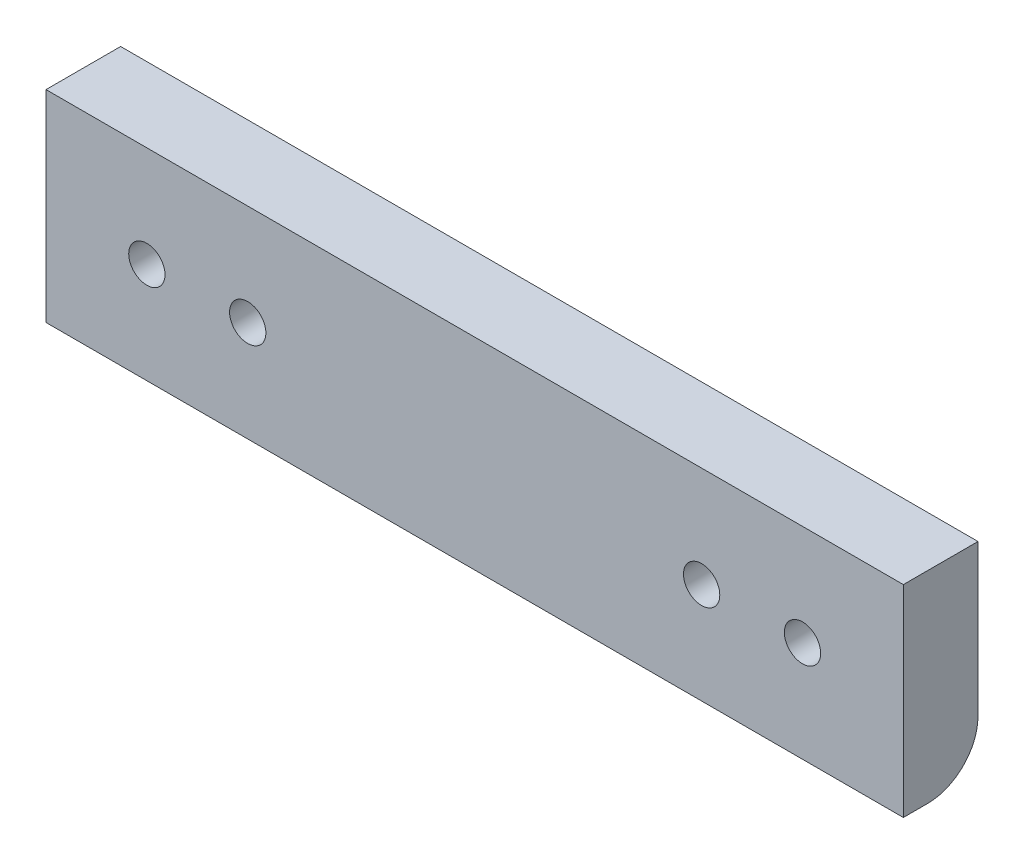
ISO-10303-21;
HEADER;
FILE_DESCRIPTION(('STEP AP214'),'2;1');
FILE_NAME('part.step','',(''),(''),'','','');
FILE_SCHEMA(('AUTOMOTIVE_DESIGN { 1 0 10303 214 1 1 1 1 }'));
ENDSEC;
DATA;
#1=APPLICATION_CONTEXT('core data for automotive mechanical design processes');
#2=APPLICATION_PROTOCOL_DEFINITION('international standard','automotive_design',2000,#1);
#3=PRODUCT_CONTEXT('',#1,'mechanical');
#4=PRODUCT('Part','Part','',(#3));
#5=PRODUCT_RELATED_PRODUCT_CATEGORY('part','',(#4));
#6=PRODUCT_DEFINITION_FORMATION('','',#4);
#7=PRODUCT_DEFINITION_CONTEXT('part definition',#1,'design');
#8=PRODUCT_DEFINITION('design','',#6,#7);
#9=PRODUCT_DEFINITION_SHAPE('','',#8);
#10=(LENGTH_UNIT() NAMED_UNIT(*) SI_UNIT(.MILLI.,.METRE.));
#11=(NAMED_UNIT(*) PLANE_ANGLE_UNIT() SI_UNIT($,.RADIAN.));
#12=(NAMED_UNIT(*) SI_UNIT($,.STERADIAN.) SOLID_ANGLE_UNIT());
#13=UNCERTAINTY_MEASURE_WITH_UNIT(LENGTH_MEASURE(1.E-05),#10,'distance_accuracy_value','');
#14=(GEOMETRIC_REPRESENTATION_CONTEXT(3) GLOBAL_UNCERTAINTY_ASSIGNED_CONTEXT((#13)) GLOBAL_UNIT_ASSIGNED_CONTEXT((#10,
#11,#12)) REPRESENTATION_CONTEXT('',''));
#15=CARTESIAN_POINT('',(0.,0.,0.));
#16=DIRECTION('',(0.,0.,1.));
#17=DIRECTION('',(1.,0.,0.));
#18=AXIS2_PLACEMENT_3D('',#15,#16,#17);
#19=CARTESIAN_POINT('',(-32.5,0.,7.4));
#20=DIRECTION('',(0.,0.,-1.));
#21=DIRECTION('',(-1.,0.,0.));
#22=AXIS2_PLACEMENT_3D('',#19,#20,#21);
#23=CYLINDRICAL_SURFACE('',#22,1.8);
#24=CARTESIAN_POINT('',(-32.5,0.,7.4));
#25=DIRECTION('',(0.,0.,1.));
#26=DIRECTION('',(1.,0.,0.));
#27=AXIS2_PLACEMENT_3D('',#24,#25,#26);
#28=CIRCLE('',#27,1.8);
#29=CARTESIAN_POINT('',(-30.7,0.,7.4));
#30=VERTEX_POINT('',#29);
#31=EDGE_CURVE('E437',#30,#30,#28,.T.);
#32=ORIENTED_EDGE('',*,*,#31,.T.);
#33=EDGE_LOOP('',(#32));
#34=FACE_BOUND('',#33,.T.);
#35=CARTESIAN_POINT('',(-32.5,0.,4.4));
#36=DIRECTION('',(0.,0.,-1.));
#37=DIRECTION('',(-1.,0.,0.));
#38=AXIS2_PLACEMENT_3D('',#35,#36,#37);
#39=CIRCLE('',#38,1.8);
#40=CARTESIAN_POINT('',(-34.3,0.,4.4));
#41=VERTEX_POINT('',#40);
#42=EDGE_CURVE('E431',#41,#41,#39,.T.);
#43=ORIENTED_EDGE('',*,*,#42,.T.);
#44=EDGE_LOOP('',(#43));
#45=FACE_BOUND('',#44,.T.);
#46=ADVANCED_FACE('F34',(#34,#45),#23,.F.);
#47=CARTESIAN_POINT('',(22.5,0.,7.4));
#48=DIRECTION('',(0.,0.,-1.));
#49=DIRECTION('',(-1.,0.,0.));
#50=AXIS2_PLACEMENT_3D('',#47,#48,#49);
#51=CYLINDRICAL_SURFACE('',#50,1.8);
#52=CARTESIAN_POINT('',(22.5,0.,7.4));
#53=DIRECTION('',(0.,0.,1.));
#54=DIRECTION('',(1.,0.,0.));
#55=AXIS2_PLACEMENT_3D('',#52,#53,#54);
#56=CIRCLE('',#55,1.8);
#57=CARTESIAN_POINT('',(24.3,0.,7.4));
#58=VERTEX_POINT('',#57);
#59=EDGE_CURVE('E427',#58,#58,#56,.T.);
#60=ORIENTED_EDGE('',*,*,#59,.T.);
#61=EDGE_LOOP('',(#60));
#62=FACE_BOUND('',#61,.T.);
#63=CARTESIAN_POINT('',(22.5,0.,4.4));
#64=DIRECTION('',(0.,0.,-1.));
#65=DIRECTION('',(-1.,0.,0.));
#66=AXIS2_PLACEMENT_3D('',#63,#64,#65);
#67=CIRCLE('',#66,1.8);
#68=CARTESIAN_POINT('',(20.7,0.,4.4));
#69=VERTEX_POINT('',#68);
#70=EDGE_CURVE('E276',#69,#69,#67,.T.);
#71=ORIENTED_EDGE('',*,*,#70,.T.);
#72=EDGE_LOOP('',(#71));
#73=FACE_BOUND('',#72,.T.);
#74=ADVANCED_FACE('F504',(#62,#73),#51,.F.);
#75=CARTESIAN_POINT('',(0.,0.,7.4));
#76=DIRECTION('',(0.,0.,1.));
#77=DIRECTION('',(1.,0.,0.));
#78=AXIS2_PLACEMENT_3D('',#75,#76,#77);
#79=PLANE('',#78);
#80=CARTESIAN_POINT('',(32.5,0.,7.4));
#81=DIRECTION('',(0.,0.,1.));
#82=DIRECTION('',(-1.,0.,0.));
#83=AXIS2_PLACEMENT_3D('',#80,#81,#82);
#84=CIRCLE('',#83,1.8);
#85=CARTESIAN_POINT('',(30.7,0.,7.4));
#86=VERTEX_POINT('',#85);
#87=EDGE_CURVE('E430',#86,#86,#84,.T.);
#88=ORIENTED_EDGE('',*,*,#87,.F.);
#89=EDGE_LOOP('',(#88));
#90=FACE_BOUND('',#89,.T.);
#91=ORIENTED_EDGE('',*,*,#31,.F.);
#92=EDGE_LOOP('',(#91));
#93=FACE_BOUND('',#92,.T.);
#94=DIRECTION('',(0.,-1.,0.));
#95=VECTOR('',#94,1.);
#96=CARTESIAN_POINT('',(-42.5,-10.,7.4));
#97=LINE('',#96,#95);
#98=CARTESIAN_POINT('',(-42.5,10.,7.4));
#99=VERTEX_POINT('',#98);
#100=CARTESIAN_POINT('',(-42.5,-10.,7.4));
#101=VERTEX_POINT('',#100);
#102=EDGE_CURVE('E441',#99,#101,#97,.T.);
#103=ORIENTED_EDGE('',*,*,#102,.T.);
#104=DIRECTION('',(1.,0.,0.));
#105=VECTOR('',#104,1.);
#106=CARTESIAN_POINT('',(42.5,-10.,7.4));
#107=LINE('',#106,#105);
#108=CARTESIAN_POINT('',(42.5,-10.,7.4));
#109=VERTEX_POINT('',#108);
#110=EDGE_CURVE('E444',#101,#109,#107,.T.);
#111=ORIENTED_EDGE('',*,*,#110,.T.);
#112=DIRECTION('',(0.,1.,0.));
#113=VECTOR('',#112,1.);
#114=CARTESIAN_POINT('',(42.5,-10.,7.4));
#115=LINE('',#114,#113);
#116=CARTESIAN_POINT('',(42.5,10.,7.4));
#117=VERTEX_POINT('',#116);
#118=EDGE_CURVE('E447',#109,#117,#115,.T.);
#119=ORIENTED_EDGE('',*,*,#118,.T.);
#120=DIRECTION('',(-1.,0.,0.));
#121=VECTOR('',#120,1.);
#122=CARTESIAN_POINT('',(42.5,10.,7.4));
#123=LINE('',#122,#121);
#124=EDGE_CURVE('E449',#117,#99,#123,.T.);
#125=ORIENTED_EDGE('',*,*,#124,.T.);
#126=EDGE_LOOP('',(#103,#111,#119,#125));
#127=FACE_BOUND('',#126,.T.);
#128=CARTESIAN_POINT('',(-22.5,0.,7.4));
#129=DIRECTION('',(0.,0.,1.));
#130=DIRECTION('',(-1.,0.,0.));
#131=AXIS2_PLACEMENT_3D('',#128,#129,#130);
#132=CIRCLE('',#131,1.8);
#133=CARTESIAN_POINT('',(-24.3,0.,7.4));
#134=VERTEX_POINT('',#133);
#135=EDGE_CURVE('E434',#134,#134,#132,.T.);
#136=ORIENTED_EDGE('',*,*,#135,.F.);
#137=EDGE_LOOP('',(#136));
#138=FACE_BOUND('',#137,.T.);
#139=ORIENTED_EDGE('',*,*,#59,.F.);
#140=EDGE_LOOP('',(#139));
#141=FACE_BOUND('',#140,.T.);
#142=ADVANCED_FACE('F491',(#90,#93,#127,#138,#141),#79,.T.);
#143=CARTESIAN_POINT('',(0.,0.,0.));
#144=DIRECTION('',(0.,0.,1.));
#145=DIRECTION('',(1.,0.,0.));
#146=AXIS2_PLACEMENT_3D('',#143,#144,#145);
#147=PLANE('',#146);
#148=DIRECTION('',(0.499999999999999,0.866025403784439,0.));
#149=VECTOR('',#148,1.);
#150=CARTESIAN_POINT('',(-36.1950417228136,0.,0.));
#151=LINE('',#150,#149);
#152=CARTESIAN_POINT('',(-36.1950417228136,0.,0.));
#153=VERTEX_POINT('',#152);
#154=CARTESIAN_POINT('',(-34.3475208614068,3.2,0.));
#155=VERTEX_POINT('',#154);
#156=EDGE_CURVE('E263',#153,#155,#151,.T.);
#157=ORIENTED_EDGE('',*,*,#156,.F.);
#158=DIRECTION('',(-0.499999999999999,0.866025403784439,0.));
#159=VECTOR('',#158,1.);
#160=CARTESIAN_POINT('',(-34.3475208614068,-3.2,0.));
#161=LINE('',#160,#159);
#162=CARTESIAN_POINT('',(-34.3475208614068,-3.2,0.));
#163=VERTEX_POINT('',#162);
#164=EDGE_CURVE('E231',#163,#153,#161,.T.);
#165=ORIENTED_EDGE('',*,*,#164,.F.);
#166=DIRECTION('',(-1.,0.,0.));
#167=VECTOR('',#166,1.);
#168=CARTESIAN_POINT('',(-30.6524791385932,-3.2,0.));
#169=LINE('',#168,#167);
#170=CARTESIAN_POINT('',(-30.6524791385932,-3.2,0.));
#171=VERTEX_POINT('',#170);
#172=EDGE_CURVE('E249',#171,#163,#169,.T.);
#173=ORIENTED_EDGE('',*,*,#172,.F.);
#174=DIRECTION('',(-0.499999999999999,-0.866025403784439,0.));
#175=VECTOR('',#174,1.);
#176=CARTESIAN_POINT('',(-28.8049582771864,0.,0.));
#177=LINE('',#176,#175);
#178=CARTESIAN_POINT('',(-28.8049582771864,0.,0.));
#179=VERTEX_POINT('',#178);
#180=EDGE_CURVE('E252',#179,#171,#177,.T.);
#181=ORIENTED_EDGE('',*,*,#180,.F.);
#182=DIRECTION('',(0.5,-0.866025403784438,0.));
#183=VECTOR('',#182,1.);
#184=CARTESIAN_POINT('',(-30.6524791385932,3.2,0.));
#185=LINE('',#184,#183);
#186=CARTESIAN_POINT('',(-30.6524791385932,3.2,0.));
#187=VERTEX_POINT('',#186);
#188=EDGE_CURVE('E269',#187,#179,#185,.T.);
#189=ORIENTED_EDGE('',*,*,#188,.F.);
#190=DIRECTION('',(1.,0.,0.));
#191=VECTOR('',#190,1.);
#192=CARTESIAN_POINT('',(-34.3475208614068,3.2,0.));
#193=LINE('',#192,#191);
#194=EDGE_CURVE('E266',#155,#187,#193,.T.);
#195=ORIENTED_EDGE('',*,*,#194,.F.);
#196=EDGE_LOOP('',(#157,#165,#173,#181,#189,#195));
#197=FACE_BOUND('',#196,.T.);
#198=DIRECTION('',(-0.499999999999999,0.866025403784439,0.));
#199=VECTOR('',#198,1.);
#200=CARTESIAN_POINT('',(-26.1950417228136,0.,0.));
#201=LINE('',#200,#199);
#202=CARTESIAN_POINT('',(-24.3475208614068,-3.2,0.));
#203=VERTEX_POINT('',#202);
#204=CARTESIAN_POINT('',(-26.1950417228136,0.,0.));
#205=VERTEX_POINT('',#204);
#206=EDGE_CURVE('E306',#203,#205,#201,.T.);
#207=ORIENTED_EDGE('',*,*,#206,.F.);
#208=DIRECTION('',(-1.,0.,0.));
#209=VECTOR('',#208,1.);
#210=CARTESIAN_POINT('',(-24.3475208614068,-3.2,0.));
#211=LINE('',#210,#209);
#212=CARTESIAN_POINT('',(-20.6524791385932,-3.2,0.));
#213=VERTEX_POINT('',#212);
#214=EDGE_CURVE('E304',#213,#203,#211,.T.);
#215=ORIENTED_EDGE('',*,*,#214,.F.);
#216=DIRECTION('',(-0.499999999999999,-0.866025403784439,0.));
#217=VECTOR('',#216,1.);
#218=CARTESIAN_POINT('',(-20.6524791385932,-3.2,0.));
#219=LINE('',#218,#217);
#220=CARTESIAN_POINT('',(-18.8049582771864,0.,0.));
#221=VERTEX_POINT('',#220);
#222=EDGE_CURVE('E288',#221,#213,#219,.T.);
#223=ORIENTED_EDGE('',*,*,#222,.F.);
#224=DIRECTION('',(0.499999999999999,-0.866025403784439,0.));
#225=VECTOR('',#224,1.);
#226=CARTESIAN_POINT('',(-18.8049582771864,0.,0.));
#227=LINE('',#226,#225);
#228=CARTESIAN_POINT('',(-20.6524791385932,3.2,0.));
#229=VERTEX_POINT('',#228);
#230=EDGE_CURVE('E316',#229,#221,#227,.T.);
#231=ORIENTED_EDGE('',*,*,#230,.F.);
#232=DIRECTION('',(1.,0.,0.));
#233=VECTOR('',#232,1.);
#234=CARTESIAN_POINT('',(-20.6524791385932,3.2,0.));
#235=LINE('',#234,#233);
#236=CARTESIAN_POINT('',(-24.3475208614068,3.2,0.));
#237=VERTEX_POINT('',#236);
#238=EDGE_CURVE('E313',#237,#229,#235,.T.);
#239=ORIENTED_EDGE('',*,*,#238,.F.);
#240=DIRECTION('',(0.5,0.866025403784438,0.));
#241=VECTOR('',#240,1.);
#242=CARTESIAN_POINT('',(-24.3475208614068,3.2,0.));
#243=LINE('',#242,#241);
#244=EDGE_CURVE('E310',#205,#237,#243,.T.);
#245=ORIENTED_EDGE('',*,*,#244,.F.);
#246=EDGE_LOOP('',(#207,#215,#223,#231,#239,#245));
#247=FACE_BOUND('',#246,.T.);
#248=DIRECTION('',(0.499999999999999,0.866025403784439,0.));
#249=VECTOR('',#248,1.);
#250=CARTESIAN_POINT('',(18.8049582771864,0.,0.));
#251=LINE('',#250,#249);
#252=CARTESIAN_POINT('',(18.8049582771864,0.,0.));
#253=VERTEX_POINT('',#252);
#254=CARTESIAN_POINT('',(20.6524791385932,3.2,0.));
#255=VERTEX_POINT('',#254);
#256=EDGE_CURVE('E354',#253,#255,#251,.T.);
#257=ORIENTED_EDGE('',*,*,#256,.F.);
#258=DIRECTION('',(-0.499999999999999,0.866025403784439,0.));
#259=VECTOR('',#258,1.);
#260=CARTESIAN_POINT('',(20.6524791385932,-3.2,0.));
#261=LINE('',#260,#259);
#262=CARTESIAN_POINT('',(20.6524791385932,-3.2,0.));
#263=VERTEX_POINT('',#262);
#264=EDGE_CURVE('E352',#263,#253,#261,.T.);
#265=ORIENTED_EDGE('',*,*,#264,.F.);
#266=DIRECTION('',(-1.,0.,0.));
#267=VECTOR('',#266,1.);
#268=CARTESIAN_POINT('',(24.3475208614068,-3.2,0.));
#269=LINE('',#268,#267);
#270=CARTESIAN_POINT('',(24.3475208614068,-3.2,0.));
#271=VERTEX_POINT('',#270);
#272=EDGE_CURVE('E336',#271,#263,#269,.T.);
#273=ORIENTED_EDGE('',*,*,#272,.F.);
#274=DIRECTION('',(-0.499999999999999,-0.866025403784439,0.));
#275=VECTOR('',#274,1.);
#276=CARTESIAN_POINT('',(26.1950417228136,0.,0.));
#277=LINE('',#276,#275);
#278=CARTESIAN_POINT('',(26.1950417228136,0.,0.));
#279=VERTEX_POINT('',#278);
#280=EDGE_CURVE('E364',#279,#271,#277,.T.);
#281=ORIENTED_EDGE('',*,*,#280,.F.);
#282=DIRECTION('',(0.5,-0.866025403784438,0.));
#283=VECTOR('',#282,1.);
#284=CARTESIAN_POINT('',(24.3475208614068,3.2,0.));
#285=LINE('',#284,#283);
#286=CARTESIAN_POINT('',(24.3475208614068,3.2,0.));
#287=VERTEX_POINT('',#286);
#288=EDGE_CURVE('E361',#287,#279,#285,.T.);
#289=ORIENTED_EDGE('',*,*,#288,.F.);
#290=DIRECTION('',(1.,0.,0.));
#291=VECTOR('',#290,1.);
#292=CARTESIAN_POINT('',(20.6524791385932,3.2,0.));
#293=LINE('',#292,#291);
#294=EDGE_CURVE('E358',#255,#287,#293,.T.);
#295=ORIENTED_EDGE('',*,*,#294,.F.);
#296=EDGE_LOOP('',(#257,#265,#273,#281,#289,#295));
#297=FACE_BOUND('',#296,.T.);
#298=DIRECTION('',(-0.499999999999999,0.866025403784439,0.));
#299=VECTOR('',#298,1.);
#300=CARTESIAN_POINT('',(28.8049582771864,0.,0.));
#301=LINE('',#300,#299);
#302=CARTESIAN_POINT('',(30.6524791385932,-3.2,0.));
#303=VERTEX_POINT('',#302);
#304=CARTESIAN_POINT('',(28.8049582771864,0.,0.));
#305=VERTEX_POINT('',#304);
#306=EDGE_CURVE('E402',#303,#305,#301,.T.);
#307=ORIENTED_EDGE('',*,*,#306,.F.);
#308=DIRECTION('',(-1.,0.,0.));
#309=VECTOR('',#308,1.);
#310=CARTESIAN_POINT('',(30.6524791385932,-3.2,0.));
#311=LINE('',#310,#309);
#312=CARTESIAN_POINT('',(34.3475208614068,-3.2,0.));
#313=VERTEX_POINT('',#312);
#314=EDGE_CURVE('E400',#313,#303,#311,.T.);
#315=ORIENTED_EDGE('',*,*,#314,.F.);
#316=DIRECTION('',(-0.499999999999999,-0.866025403784439,0.));
#317=VECTOR('',#316,1.);
#318=CARTESIAN_POINT('',(34.3475208614068,-3.2,0.));
#319=LINE('',#318,#317);
#320=CARTESIAN_POINT('',(36.1950417228136,0.,0.));
#321=VERTEX_POINT('',#320);
#322=EDGE_CURVE('E384',#321,#313,#319,.T.);
#323=ORIENTED_EDGE('',*,*,#322,.F.);
#324=DIRECTION('',(0.499999999999999,-0.866025403784439,0.));
#325=VECTOR('',#324,1.);
#326=CARTESIAN_POINT('',(36.1950417228136,0.,0.));
#327=LINE('',#326,#325);
#328=CARTESIAN_POINT('',(34.3475208614068,3.2,0.));
#329=VERTEX_POINT('',#328);
#330=EDGE_CURVE('E411',#329,#321,#327,.T.);
#331=ORIENTED_EDGE('',*,*,#330,.F.);
#332=DIRECTION('',(1.,0.,0.));
#333=VECTOR('',#332,1.);
#334=CARTESIAN_POINT('',(34.3475208614068,3.2,0.));
#335=LINE('',#334,#333);
#336=CARTESIAN_POINT('',(30.6524791385932,3.2,0.));
#337=VERTEX_POINT('',#336);
#338=EDGE_CURVE('E408',#337,#329,#335,.T.);
#339=ORIENTED_EDGE('',*,*,#338,.F.);
#340=DIRECTION('',(0.5,0.866025403784438,0.));
#341=VECTOR('',#340,1.);
#342=CARTESIAN_POINT('',(30.6524791385932,3.2,0.));
#343=LINE('',#342,#341);
#344=EDGE_CURVE('E405',#305,#337,#343,.T.);
#345=ORIENTED_EDGE('',*,*,#344,.F.);
#346=EDGE_LOOP('',(#307,#315,#323,#331,#339,#345));
#347=FACE_BOUND('',#346,.T.);
#348=DIRECTION('',(0.,1.,0.));
#349=VECTOR('',#348,1.);
#350=CARTESIAN_POINT('',(42.5,-10.,0.));
#351=LINE('',#350,#349);
#352=CARTESIAN_POINT('',(42.5,-5.,0.));
#353=VERTEX_POINT('',#352);
#354=CARTESIAN_POINT('',(42.5,10.,0.));
#355=VERTEX_POINT('',#354);
#356=EDGE_CURVE('E453',#353,#355,#351,.T.);
#357=ORIENTED_EDGE('',*,*,#356,.F.);
#358=DIRECTION('',(1.,0.,0.));
#359=VECTOR('',#358,1.);
#360=CARTESIAN_POINT('',(0.,-5.,0.));
#361=LINE('',#360,#359);
#362=CARTESIAN_POINT('',(-42.5,-5.,0.));
#363=VERTEX_POINT('',#362);
#364=EDGE_CURVE('E42',#353,#363,#361,.F.);
#365=ORIENTED_EDGE('',*,*,#364,.T.);
#366=DIRECTION('',(0.,-1.,0.));
#367=VECTOR('',#366,1.);
#368=CARTESIAN_POINT('',(-42.5,-10.,0.));
#369=LINE('',#368,#367);
#370=CARTESIAN_POINT('',(-42.5,10.,0.));
#371=VERTEX_POINT('',#370);
#372=EDGE_CURVE('E440',#371,#363,#369,.T.);
#373=ORIENTED_EDGE('',*,*,#372,.F.);
#374=DIRECTION('',(-1.,0.,0.));
#375=VECTOR('',#374,1.);
#376=CARTESIAN_POINT('',(42.5,10.,0.));
#377=LINE('',#376,#375);
#378=EDGE_CURVE('E445',#355,#371,#377,.T.);
#379=ORIENTED_EDGE('',*,*,#378,.F.);
#380=EDGE_LOOP('',(#357,#365,#373,#379));
#381=FACE_BOUND('',#380,.T.);
#382=ADVANCED_FACE('F519',(#197,#247,#297,#347,#381),#147,.F.);
#383=CARTESIAN_POINT('',(-42.5,-10.,7.4));
#384=DIRECTION('',(1.,0.,0.));
#385=DIRECTION('',(0.,0.,-1.));
#386=AXIS2_PLACEMENT_3D('',#383,#384,#385);
#387=PLANE('',#386);
#388=ORIENTED_EDGE('',*,*,#372,.T.);
#389=CARTESIAN_POINT('',(-42.5,-5.,5.));
#390=DIRECTION('',(1.,0.,0.));
#391=DIRECTION('',(0.,0.,-1.));
#392=AXIS2_PLACEMENT_3D('',#389,#390,#391);
#393=CIRCLE('',#392,5.);
#394=CARTESIAN_POINT('',(-42.5,-10.,5.));
#395=VERTEX_POINT('',#394);
#396=EDGE_CURVE('E11',#363,#395,#393,.F.);
#397=ORIENTED_EDGE('',*,*,#396,.T.);
#398=DIRECTION('',(0.,0.,-1.));
#399=VECTOR('',#398,1.);
#400=CARTESIAN_POINT('',(-42.5,-10.,7.4));
#401=LINE('',#400,#399);
#402=EDGE_CURVE('E463',#101,#395,#401,.T.);
#403=ORIENTED_EDGE('',*,*,#402,.F.);
#404=ORIENTED_EDGE('',*,*,#102,.F.);
#405=DIRECTION('',(0.,0.,-1.));
#406=VECTOR('',#405,1.);
#407=CARTESIAN_POINT('',(-42.5,10.,7.4));
#408=LINE('',#407,#406);
#409=EDGE_CURVE('E451',#99,#371,#408,.T.);
#410=ORIENTED_EDGE('',*,*,#409,.T.);
#411=EDGE_LOOP('',(#388,#397,#403,#404,#410));
#412=FACE_BOUND('',#411,.T.);
#413=ADVANCED_FACE('F496',(#412),#387,.F.);
#414=CARTESIAN_POINT('',(42.5,-10.,7.4));
#415=DIRECTION('',(0.,1.,0.));
#416=DIRECTION('',(0.,0.,1.));
#417=AXIS2_PLACEMENT_3D('',#414,#415,#416);
#418=PLANE('',#417);
#419=ORIENTED_EDGE('',*,*,#402,.T.);
#420=DIRECTION('',(1.,0.,0.));
#421=VECTOR('',#420,1.);
#422=CARTESIAN_POINT('',(42.5,-10.,5.));
#423=LINE('',#422,#421);
#424=CARTESIAN_POINT('',(42.5,-10.,5.));
#425=VERTEX_POINT('',#424);
#426=EDGE_CURVE('E466',#395,#425,#423,.T.);
#427=ORIENTED_EDGE('',*,*,#426,.T.);
#428=DIRECTION('',(0.,0.,-1.));
#429=VECTOR('',#428,1.);
#430=CARTESIAN_POINT('',(42.5,-10.,7.4));
#431=LINE('',#430,#429);
#432=EDGE_CURVE('E461',#109,#425,#431,.T.);
#433=ORIENTED_EDGE('',*,*,#432,.F.);
#434=ORIENTED_EDGE('',*,*,#110,.F.);
#435=EDGE_LOOP('',(#419,#427,#433,#434));
#436=FACE_BOUND('',#435,.T.);
#437=ADVANCED_FACE('F482',(#436),#418,.F.);
#438=CARTESIAN_POINT('',(42.5,-10.,7.4));
#439=DIRECTION('',(-1.,0.,0.));
#440=DIRECTION('',(0.,0.,1.));
#441=AXIS2_PLACEMENT_3D('',#438,#439,#440);
#442=PLANE('',#441);
#443=ORIENTED_EDGE('',*,*,#432,.T.);
#444=CARTESIAN_POINT('',(42.5,-5.,5.));
#445=DIRECTION('',(-1.,0.,0.));
#446=DIRECTION('',(0.,0.,1.));
#447=AXIS2_PLACEMENT_3D('',#444,#445,#446);
#448=CIRCLE('',#447,5.);
#449=EDGE_CURVE('E56',#425,#353,#448,.F.);
#450=ORIENTED_EDGE('',*,*,#449,.T.);
#451=ORIENTED_EDGE('',*,*,#356,.T.);
#452=DIRECTION('',(0.,0.,-1.));
#453=VECTOR('',#452,1.);
#454=CARTESIAN_POINT('',(42.5,10.,7.4));
#455=LINE('',#454,#453);
#456=EDGE_CURVE('E458',#117,#355,#455,.T.);
#457=ORIENTED_EDGE('',*,*,#456,.F.);
#458=ORIENTED_EDGE('',*,*,#118,.F.);
#459=EDGE_LOOP('',(#443,#450,#451,#457,#458));
#460=FACE_BOUND('',#459,.T.);
#461=ADVANCED_FACE('F487',(#460),#442,.F.);
#462=CARTESIAN_POINT('',(42.5,10.,7.4));
#463=DIRECTION('',(0.,-1.,0.));
#464=DIRECTION('',(0.,0.,-1.));
#465=AXIS2_PLACEMENT_3D('',#462,#463,#464);
#466=PLANE('',#465);
#467=ORIENTED_EDGE('',*,*,#378,.T.);
#468=ORIENTED_EDGE('',*,*,#409,.F.);
#469=ORIENTED_EDGE('',*,*,#124,.F.);
#470=ORIENTED_EDGE('',*,*,#456,.T.);
#471=EDGE_LOOP('',(#467,#468,#469,#470));
#472=FACE_BOUND('',#471,.T.);
#473=ADVANCED_FACE('F524',(#472),#466,.F.);
#474=CARTESIAN_POINT('',(-22.5,0.,7.4));
#475=DIRECTION('',(0.,0.,-1.));
#476=DIRECTION('',(-1.,0.,0.));
#477=AXIS2_PLACEMENT_3D('',#474,#475,#476);
#478=CYLINDRICAL_SURFACE('',#477,1.8);
#479=CARTESIAN_POINT('',(-22.5,0.,4.4));
#480=DIRECTION('',(0.,0.,1.));
#481=DIRECTION('',(1.,0.,0.));
#482=AXIS2_PLACEMENT_3D('',#479,#480,#481);
#483=CIRCLE('',#482,1.8);
#484=CARTESIAN_POINT('',(-20.7,0.,4.4));
#485=VERTEX_POINT('',#484);
#486=EDGE_CURVE('E472',#485,#485,#483,.T.);
#487=ORIENTED_EDGE('',*,*,#486,.F.);
#488=EDGE_LOOP('',(#487));
#489=FACE_BOUND('',#488,.T.);
#490=ORIENTED_EDGE('',*,*,#135,.T.);
#491=EDGE_LOOP('',(#490));
#492=FACE_BOUND('',#491,.T.);
#493=ADVANCED_FACE('F515',(#489,#492),#478,.F.);
#494=CARTESIAN_POINT('',(32.5,0.,7.4));
#495=DIRECTION('',(0.,0.,-1.));
#496=DIRECTION('',(-1.,0.,0.));
#497=AXIS2_PLACEMENT_3D('',#494,#495,#496);
#498=CYLINDRICAL_SURFACE('',#497,1.8);
#499=CARTESIAN_POINT('',(32.5,0.,4.4));
#500=DIRECTION('',(0.,0.,1.));
#501=DIRECTION('',(1.,0.,0.));
#502=AXIS2_PLACEMENT_3D('',#499,#500,#501);
#503=CIRCLE('',#502,1.8);
#504=CARTESIAN_POINT('',(34.3,0.,4.4));
#505=VERTEX_POINT('',#504);
#506=EDGE_CURVE('E469',#505,#505,#503,.T.);
#507=ORIENTED_EDGE('',*,*,#506,.F.);
#508=EDGE_LOOP('',(#507));
#509=FACE_BOUND('',#508,.T.);
#510=ORIENTED_EDGE('',*,*,#87,.T.);
#511=EDGE_LOOP('',(#510));
#512=FACE_BOUND('',#511,.T.);
#513=ADVANCED_FACE('F555',(#509,#512),#498,.F.);
#514=CARTESIAN_POINT('',(20.6524791385932,-3.2,4.4));
#515=DIRECTION('',(-0.866025403784439,-0.499999999999999,0.));
#516=DIRECTION('',(0.499999999999999,-0.866025403784439,0.));
#517=AXIS2_PLACEMENT_3D('',#514,#515,#516);
#518=PLANE('',#517);
#519=ORIENTED_EDGE('',*,*,#264,.T.);
#520=DIRECTION('',(0.,0.,-1.));
#521=VECTOR('',#520,1.);
#522=CARTESIAN_POINT('',(18.8049582771864,0.,4.4));
#523=LINE('',#522,#521);
#524=CARTESIAN_POINT('',(18.8049582771864,0.,4.4));
#525=VERTEX_POINT('',#524);
#526=EDGE_CURVE('E351',#525,#253,#523,.T.);
#527=ORIENTED_EDGE('',*,*,#526,.F.);
#528=DIRECTION('',(-0.499999999999999,0.866025403784439,0.));
#529=VECTOR('',#528,1.);
#530=CARTESIAN_POINT('',(20.6524791385932,-3.2,4.4));
#531=LINE('',#530,#529);
#532=CARTESIAN_POINT('',(20.6524791385932,-3.2,4.4));
#533=VERTEX_POINT('',#532);
#534=EDGE_CURVE('E332',#533,#525,#531,.T.);
#535=ORIENTED_EDGE('',*,*,#534,.F.);
#536=DIRECTION('',(0.,0.,-1.));
#537=VECTOR('',#536,1.);
#538=CARTESIAN_POINT('',(20.6524791385932,-3.2,4.4));
#539=LINE('',#538,#537);
#540=EDGE_CURVE('E307',#533,#263,#539,.T.);
#541=ORIENTED_EDGE('',*,*,#540,.T.);
#542=EDGE_LOOP('',(#519,#527,#535,#541));
#543=FACE_BOUND('',#542,.T.);
#544=ADVANCED_FACE('F563',(#543),#518,.F.);
#545=CARTESIAN_POINT('',(24.3475208614068,-3.2,4.4));
#546=DIRECTION('',(0.,-1.,0.));
#547=DIRECTION('',(1.,0.,0.));
#548=AXIS2_PLACEMENT_3D('',#545,#546,#547);
#549=PLANE('',#548);
#550=ORIENTED_EDGE('',*,*,#272,.T.);
#551=ORIENTED_EDGE('',*,*,#540,.F.);
#552=DIRECTION('',(-1.,0.,0.));
#553=VECTOR('',#552,1.);
#554=CARTESIAN_POINT('',(24.3475208614068,-3.2,4.4));
#555=LINE('',#554,#553);
#556=CARTESIAN_POINT('',(24.3475208614068,-3.2,4.4));
#557=VERTEX_POINT('',#556);
#558=EDGE_CURVE('E348',#557,#533,#555,.T.);
#559=ORIENTED_EDGE('',*,*,#558,.F.);
#560=DIRECTION('',(0.,0.,-1.));
#561=VECTOR('',#560,1.);
#562=CARTESIAN_POINT('',(24.3475208614068,-3.2,4.4));
#563=LINE('',#562,#561);
#564=EDGE_CURVE('E370',#557,#271,#563,.T.);
#565=ORIENTED_EDGE('',*,*,#564,.T.);
#566=EDGE_LOOP('',(#550,#551,#559,#565));
#567=FACE_BOUND('',#566,.T.);
#568=ADVANCED_FACE('F570',(#567),#549,.F.);
#569=CARTESIAN_POINT('',(26.1950417228136,0.,4.4));
#570=DIRECTION('',(0.866025403784439,-0.499999999999999,0.));
#571=DIRECTION('',(0.499999999999999,0.866025403784439,0.));
#572=AXIS2_PLACEMENT_3D('',#569,#570,#571);
#573=PLANE('',#572);
#574=ORIENTED_EDGE('',*,*,#280,.T.);
#575=ORIENTED_EDGE('',*,*,#564,.F.);
#576=DIRECTION('',(-0.499999999999999,-0.866025403784439,0.));
#577=VECTOR('',#576,1.);
#578=CARTESIAN_POINT('',(26.1950417228136,0.,4.4));
#579=LINE('',#578,#577);
#580=CARTESIAN_POINT('',(26.1950417228136,0.,4.4));
#581=VERTEX_POINT('',#580);
#582=EDGE_CURVE('E345',#581,#557,#579,.T.);
#583=ORIENTED_EDGE('',*,*,#582,.F.);
#584=DIRECTION('',(0.,0.,-1.));
#585=VECTOR('',#584,1.);
#586=CARTESIAN_POINT('',(26.1950417228136,0.,4.4));
#587=LINE('',#586,#585);
#588=EDGE_CURVE('E372',#581,#279,#587,.T.);
#589=ORIENTED_EDGE('',*,*,#588,.T.);
#590=EDGE_LOOP('',(#574,#575,#583,#589));
#591=FACE_BOUND('',#590,.T.);
#592=ADVANCED_FACE('F578',(#591),#573,.F.);
#593=CARTESIAN_POINT('',(24.3475208614068,3.2,4.4));
#594=DIRECTION('',(0.866025403784438,0.5,0.));
#595=DIRECTION('',(-0.5,0.866025403784439,0.));
#596=AXIS2_PLACEMENT_3D('',#593,#594,#595);
#597=PLANE('',#596);
#598=ORIENTED_EDGE('',*,*,#288,.T.);
#599=ORIENTED_EDGE('',*,*,#588,.F.);
#600=DIRECTION('',(0.5,-0.866025403784438,0.));
#601=VECTOR('',#600,1.);
#602=CARTESIAN_POINT('',(24.3475208614068,3.2,4.4));
#603=LINE('',#602,#601);
#604=CARTESIAN_POINT('',(24.3475208614068,3.2,4.4));
#605=VERTEX_POINT('',#604);
#606=EDGE_CURVE('E342',#605,#581,#603,.T.);
#607=ORIENTED_EDGE('',*,*,#606,.F.);
#608=DIRECTION('',(0.,0.,-1.));
#609=VECTOR('',#608,1.);
#610=CARTESIAN_POINT('',(24.3475208614068,3.2,4.4));
#611=LINE('',#610,#609);
#612=EDGE_CURVE('E374',#605,#287,#611,.T.);
#613=ORIENTED_EDGE('',*,*,#612,.T.);
#614=EDGE_LOOP('',(#598,#599,#607,#613));
#615=FACE_BOUND('',#614,.T.);
#616=ADVANCED_FACE('F586',(#615),#597,.F.);
#617=CARTESIAN_POINT('',(20.6524791385932,3.2,4.4));
#618=DIRECTION('',(0.,1.,0.));
#619=DIRECTION('',(0.,0.,1.));
#620=AXIS2_PLACEMENT_3D('',#617,#618,#619);
#621=PLANE('',#620);
#622=ORIENTED_EDGE('',*,*,#294,.T.);
#623=ORIENTED_EDGE('',*,*,#612,.F.);
#624=DIRECTION('',(1.,0.,0.));
#625=VECTOR('',#624,1.);
#626=CARTESIAN_POINT('',(20.6524791385932,3.2,4.4));
#627=LINE('',#626,#625);
#628=CARTESIAN_POINT('',(20.6524791385932,3.2,4.4));
#629=VERTEX_POINT('',#628);
#630=EDGE_CURVE('E339',#629,#605,#627,.T.);
#631=ORIENTED_EDGE('',*,*,#630,.F.);
#632=DIRECTION('',(0.,0.,-1.));
#633=VECTOR('',#632,1.);
#634=CARTESIAN_POINT('',(20.6524791385932,3.2,4.4));
#635=LINE('',#634,#633);
#636=EDGE_CURVE('E376',#629,#255,#635,.T.);
#637=ORIENTED_EDGE('',*,*,#636,.T.);
#638=EDGE_LOOP('',(#622,#623,#631,#637));
#639=FACE_BOUND('',#638,.T.);
#640=ADVANCED_FACE('F594',(#639),#621,.F.);
#641=CARTESIAN_POINT('',(18.8049582771864,0.,4.4));
#642=DIRECTION('',(-0.866025403784439,0.499999999999999,0.));
#643=DIRECTION('',(-0.499999999999999,-0.866025403784439,0.));
#644=AXIS2_PLACEMENT_3D('',#641,#642,#643);
#645=PLANE('',#644);
#646=ORIENTED_EDGE('',*,*,#256,.T.);
#647=ORIENTED_EDGE('',*,*,#636,.F.);
#648=DIRECTION('',(0.499999999999999,0.866025403784439,0.));
#649=VECTOR('',#648,1.);
#650=CARTESIAN_POINT('',(18.8049582771864,0.,4.4));
#651=LINE('',#650,#649);
#652=EDGE_CURVE('E335',#525,#629,#651,.T.);
#653=ORIENTED_EDGE('',*,*,#652,.F.);
#654=ORIENTED_EDGE('',*,*,#526,.T.);
#655=EDGE_LOOP('',(#646,#647,#653,#654));
#656=FACE_BOUND('',#655,.T.);
#657=ADVANCED_FACE('F602',(#656),#645,.F.);
#658=CARTESIAN_POINT('',(0.,0.,4.4));
#659=DIRECTION('',(0.,0.,-1.));
#660=DIRECTION('',(-1.,0.,0.));
#661=AXIS2_PLACEMENT_3D('',#658,#659,#660);
#662=PLANE('',#661);
#663=ORIENTED_EDGE('',*,*,#70,.F.);
#664=EDGE_LOOP('',(#663));
#665=FACE_BOUND('',#664,.T.);
#666=ORIENTED_EDGE('',*,*,#534,.T.);
#667=ORIENTED_EDGE('',*,*,#652,.T.);
#668=ORIENTED_EDGE('',*,*,#630,.T.);
#669=ORIENTED_EDGE('',*,*,#606,.T.);
#670=ORIENTED_EDGE('',*,*,#582,.T.);
#671=ORIENTED_EDGE('',*,*,#558,.T.);
#672=EDGE_LOOP('',(#666,#667,#668,#669,#670,#671));
#673=FACE_BOUND('',#672,.T.);
#674=ADVANCED_FACE('F610',(#665,#673),#662,.T.);
#675=CARTESIAN_POINT('',(30.6524791385932,-3.2,4.4));
#676=DIRECTION('',(0.,-1.,0.));
#677=DIRECTION('',(1.,0.,0.));
#678=AXIS2_PLACEMENT_3D('',#675,#676,#677);
#679=PLANE('',#678);
#680=ORIENTED_EDGE('',*,*,#314,.T.);
#681=DIRECTION('',(0.,0.,-1.));
#682=VECTOR('',#681,1.);
#683=CARTESIAN_POINT('',(30.6524791385932,-3.2,4.4));
#684=LINE('',#683,#682);
#685=CARTESIAN_POINT('',(30.6524791385932,-3.2,4.4));
#686=VERTEX_POINT('',#685);
#687=EDGE_CURVE('E399',#686,#303,#684,.T.);
#688=ORIENTED_EDGE('',*,*,#687,.F.);
#689=DIRECTION('',(-1.,0.,0.));
#690=VECTOR('',#689,1.);
#691=CARTESIAN_POINT('',(30.6524791385932,-3.2,4.4));
#692=LINE('',#691,#690);
#693=CARTESIAN_POINT('',(34.3475208614068,-3.2,4.4));
#694=VERTEX_POINT('',#693);
#695=EDGE_CURVE('E380',#694,#686,#692,.T.);
#696=ORIENTED_EDGE('',*,*,#695,.F.);
#697=DIRECTION('',(0.,0.,-1.));
#698=VECTOR('',#697,1.);
#699=CARTESIAN_POINT('',(34.3475208614068,-3.2,4.4));
#700=LINE('',#699,#698);
#701=EDGE_CURVE('E355',#694,#313,#700,.T.);
#702=ORIENTED_EDGE('',*,*,#701,.T.);
#703=EDGE_LOOP('',(#680,#688,#696,#702));
#704=FACE_BOUND('',#703,.T.);
#705=ADVANCED_FACE('F618',(#704),#679,.F.);
#706=CARTESIAN_POINT('',(34.3475208614068,-3.2,4.4));
#707=DIRECTION('',(0.866025403784439,-0.499999999999999,0.));
#708=DIRECTION('',(0.499999999999999,0.866025403784439,0.));
#709=AXIS2_PLACEMENT_3D('',#706,#707,#708);
#710=PLANE('',#709);
#711=ORIENTED_EDGE('',*,*,#322,.T.);
#712=ORIENTED_EDGE('',*,*,#701,.F.);
#713=DIRECTION('',(-0.499999999999999,-0.866025403784439,0.));
#714=VECTOR('',#713,1.);
#715=CARTESIAN_POINT('',(34.3475208614068,-3.2,4.4));
#716=LINE('',#715,#714);
#717=CARTESIAN_POINT('',(36.1950417228136,0.,4.4));
#718=VERTEX_POINT('',#717);
#719=EDGE_CURVE('E396',#718,#694,#716,.T.);
#720=ORIENTED_EDGE('',*,*,#719,.F.);
#721=DIRECTION('',(0.,0.,-1.));
#722=VECTOR('',#721,1.);
#723=CARTESIAN_POINT('',(36.1950417228136,0.,4.4));
#724=LINE('',#723,#722);
#725=EDGE_CURVE('E417',#718,#321,#724,.T.);
#726=ORIENTED_EDGE('',*,*,#725,.T.);
#727=EDGE_LOOP('',(#711,#712,#720,#726));
#728=FACE_BOUND('',#727,.T.);
#729=ADVANCED_FACE('F626',(#728),#710,.F.);
#730=CARTESIAN_POINT('',(36.1950417228136,0.,4.4));
#731=DIRECTION('',(0.866025403784439,0.499999999999999,0.));
#732=DIRECTION('',(-0.499999999999999,0.866025403784439,0.));
#733=AXIS2_PLACEMENT_3D('',#730,#731,#732);
#734=PLANE('',#733);
#735=ORIENTED_EDGE('',*,*,#330,.T.);
#736=ORIENTED_EDGE('',*,*,#725,.F.);
#737=DIRECTION('',(0.499999999999999,-0.866025403784439,0.));
#738=VECTOR('',#737,1.);
#739=CARTESIAN_POINT('',(36.1950417228136,0.,4.4));
#740=LINE('',#739,#738);
#741=CARTESIAN_POINT('',(34.3475208614068,3.2,4.4));
#742=VERTEX_POINT('',#741);
#743=EDGE_CURVE('E393',#742,#718,#740,.T.);
#744=ORIENTED_EDGE('',*,*,#743,.F.);
#745=DIRECTION('',(0.,0.,-1.));
#746=VECTOR('',#745,1.);
#747=CARTESIAN_POINT('',(34.3475208614068,3.2,4.4));
#748=LINE('',#747,#746);
#749=EDGE_CURVE('E419',#742,#329,#748,.T.);
#750=ORIENTED_EDGE('',*,*,#749,.T.);
#751=EDGE_LOOP('',(#735,#736,#744,#750));
#752=FACE_BOUND('',#751,.T.);
#753=ADVANCED_FACE('F634',(#752),#734,.F.);
#754=CARTESIAN_POINT('',(34.3475208614068,3.2,4.4));
#755=DIRECTION('',(0.,1.,0.));
#756=DIRECTION('',(0.,0.,1.));
#757=AXIS2_PLACEMENT_3D('',#754,#755,#756);
#758=PLANE('',#757);
#759=ORIENTED_EDGE('',*,*,#338,.T.);
#760=ORIENTED_EDGE('',*,*,#749,.F.);
#761=DIRECTION('',(1.,0.,0.));
#762=VECTOR('',#761,1.);
#763=CARTESIAN_POINT('',(34.3475208614068,3.2,4.4));
#764=LINE('',#763,#762);
#765=CARTESIAN_POINT('',(30.6524791385932,3.2,4.4));
#766=VERTEX_POINT('',#765);
#767=EDGE_CURVE('E390',#766,#742,#764,.T.);
#768=ORIENTED_EDGE('',*,*,#767,.F.);
#769=DIRECTION('',(0.,0.,-1.));
#770=VECTOR('',#769,1.);
#771=CARTESIAN_POINT('',(30.6524791385932,3.2,4.4));
#772=LINE('',#771,#770);
#773=EDGE_CURVE('E421',#766,#337,#772,.T.);
#774=ORIENTED_EDGE('',*,*,#773,.T.);
#775=EDGE_LOOP('',(#759,#760,#768,#774));
#776=FACE_BOUND('',#775,.T.);
#777=ADVANCED_FACE('F642',(#776),#758,.F.);
#778=CARTESIAN_POINT('',(30.6524791385932,3.2,4.4));
#779=DIRECTION('',(-0.866025403784438,0.5,0.));
#780=DIRECTION('',(-0.5,-0.866025403784439,0.));
#781=AXIS2_PLACEMENT_3D('',#778,#779,#780);
#782=PLANE('',#781);
#783=ORIENTED_EDGE('',*,*,#344,.T.);
#784=ORIENTED_EDGE('',*,*,#773,.F.);
#785=DIRECTION('',(0.5,0.866025403784438,0.));
#786=VECTOR('',#785,1.);
#787=CARTESIAN_POINT('',(30.6524791385932,3.2,4.4));
#788=LINE('',#787,#786);
#789=CARTESIAN_POINT('',(28.8049582771864,0.,4.4));
#790=VERTEX_POINT('',#789);
#791=EDGE_CURVE('E387',#790,#766,#788,.T.);
#792=ORIENTED_EDGE('',*,*,#791,.F.);
#793=DIRECTION('',(0.,0.,-1.));
#794=VECTOR('',#793,1.);
#795=CARTESIAN_POINT('',(28.8049582771864,0.,4.4));
#796=LINE('',#795,#794);
#797=EDGE_CURVE('E423',#790,#305,#796,.T.);
#798=ORIENTED_EDGE('',*,*,#797,.T.);
#799=EDGE_LOOP('',(#783,#784,#792,#798));
#800=FACE_BOUND('',#799,.T.);
#801=ADVANCED_FACE('F650',(#800),#782,.F.);
#802=CARTESIAN_POINT('',(28.8049582771864,0.,4.4));
#803=DIRECTION('',(-0.866025403784439,-0.499999999999999,0.));
#804=DIRECTION('',(0.499999999999999,-0.866025403784439,0.));
#805=AXIS2_PLACEMENT_3D('',#802,#803,#804);
#806=PLANE('',#805);
#807=ORIENTED_EDGE('',*,*,#306,.T.);
#808=ORIENTED_EDGE('',*,*,#797,.F.);
#809=DIRECTION('',(-0.499999999999999,0.866025403784439,0.));
#810=VECTOR('',#809,1.);
#811=CARTESIAN_POINT('',(28.8049582771864,0.,4.4));
#812=LINE('',#811,#810);
#813=EDGE_CURVE('E383',#686,#790,#812,.T.);
#814=ORIENTED_EDGE('',*,*,#813,.F.);
#815=ORIENTED_EDGE('',*,*,#687,.T.);
#816=EDGE_LOOP('',(#807,#808,#814,#815));
#817=FACE_BOUND('',#816,.T.);
#818=ADVANCED_FACE('F658',(#817),#806,.F.);
#819=CARTESIAN_POINT('',(0.,0.,4.4));
#820=DIRECTION('',(0.,0.,1.));
#821=DIRECTION('',(1.,0.,0.));
#822=AXIS2_PLACEMENT_3D('',#819,#820,#821);
#823=PLANE('',#822);
#824=ORIENTED_EDGE('',*,*,#506,.T.);
#825=EDGE_LOOP('',(#824));
#826=FACE_BOUND('',#825,.T.);
#827=ORIENTED_EDGE('',*,*,#695,.T.);
#828=ORIENTED_EDGE('',*,*,#813,.T.);
#829=ORIENTED_EDGE('',*,*,#791,.T.);
#830=ORIENTED_EDGE('',*,*,#767,.T.);
#831=ORIENTED_EDGE('',*,*,#743,.T.);
#832=ORIENTED_EDGE('',*,*,#719,.T.);
#833=EDGE_LOOP('',(#827,#828,#829,#830,#831,#832));
#834=FACE_BOUND('',#833,.T.);
#835=ADVANCED_FACE('F666',(#826,#834),#823,.F.);
#836=CARTESIAN_POINT('',(-24.3475208614068,-3.2,4.4));
#837=DIRECTION('',(0.,-1.,0.));
#838=DIRECTION('',(1.,0.,0.));
#839=AXIS2_PLACEMENT_3D('',#836,#837,#838);
#840=PLANE('',#839);
#841=ORIENTED_EDGE('',*,*,#214,.T.);
#842=DIRECTION('',(0.,0.,-1.));
#843=VECTOR('',#842,1.);
#844=CARTESIAN_POINT('',(-24.3475208614068,-3.2,4.4));
#845=LINE('',#844,#843);
#846=CARTESIAN_POINT('',(-24.3475208614068,-3.2,4.4));
#847=VERTEX_POINT('',#846);
#848=EDGE_CURVE('E303',#847,#203,#845,.T.);
#849=ORIENTED_EDGE('',*,*,#848,.F.);
#850=DIRECTION('',(-1.,0.,0.));
#851=VECTOR('',#850,1.);
#852=CARTESIAN_POINT('',(-24.3475208614068,-3.2,4.4));
#853=LINE('',#852,#851);
#854=CARTESIAN_POINT('',(-20.6524791385932,-3.2,4.4));
#855=VERTEX_POINT('',#854);
#856=EDGE_CURVE('E284',#855,#847,#853,.T.);
#857=ORIENTED_EDGE('',*,*,#856,.F.);
#858=DIRECTION('',(0.,0.,-1.));
#859=VECTOR('',#858,1.);
#860=CARTESIAN_POINT('',(-20.6524791385932,-3.2,4.4));
#861=LINE('',#860,#859);
#862=EDGE_CURVE('E264',#855,#213,#861,.T.);
#863=ORIENTED_EDGE('',*,*,#862,.T.);
#864=EDGE_LOOP('',(#841,#849,#857,#863));
#865=FACE_BOUND('',#864,.T.);
#866=ADVANCED_FACE('F674',(#865),#840,.F.);
#867=CARTESIAN_POINT('',(-20.6524791385932,-3.2,4.4));
#868=DIRECTION('',(0.866025403784439,-0.499999999999999,0.));
#869=DIRECTION('',(0.499999999999999,0.866025403784439,0.));
#870=AXIS2_PLACEMENT_3D('',#867,#868,#869);
#871=PLANE('',#870);
#872=ORIENTED_EDGE('',*,*,#222,.T.);
#873=ORIENTED_EDGE('',*,*,#862,.F.);
#874=DIRECTION('',(-0.499999999999999,-0.866025403784439,0.));
#875=VECTOR('',#874,1.);
#876=CARTESIAN_POINT('',(-20.6524791385932,-3.2,4.4));
#877=LINE('',#876,#875);
#878=CARTESIAN_POINT('',(-18.8049582771864,0.,4.4));
#879=VERTEX_POINT('',#878);
#880=EDGE_CURVE('E300',#879,#855,#877,.T.);
#881=ORIENTED_EDGE('',*,*,#880,.F.);
#882=DIRECTION('',(0.,0.,-1.));
#883=VECTOR('',#882,1.);
#884=CARTESIAN_POINT('',(-18.8049582771864,0.,4.4));
#885=LINE('',#884,#883);
#886=EDGE_CURVE('E322',#879,#221,#885,.T.);
#887=ORIENTED_EDGE('',*,*,#886,.T.);
#888=EDGE_LOOP('',(#872,#873,#881,#887));
#889=FACE_BOUND('',#888,.T.);
#890=ADVANCED_FACE('F682',(#889),#871,.F.);
#891=CARTESIAN_POINT('',(-18.8049582771864,0.,4.4));
#892=DIRECTION('',(0.866025403784439,0.499999999999999,0.));
#893=DIRECTION('',(-0.499999999999999,0.866025403784439,0.));
#894=AXIS2_PLACEMENT_3D('',#891,#892,#893);
#895=PLANE('',#894);
#896=ORIENTED_EDGE('',*,*,#230,.T.);
#897=ORIENTED_EDGE('',*,*,#886,.F.);
#898=DIRECTION('',(0.499999999999999,-0.866025403784439,0.));
#899=VECTOR('',#898,1.);
#900=CARTESIAN_POINT('',(-18.8049582771864,0.,4.4));
#901=LINE('',#900,#899);
#902=CARTESIAN_POINT('',(-20.6524791385932,3.2,4.4));
#903=VERTEX_POINT('',#902);
#904=EDGE_CURVE('E297',#903,#879,#901,.T.);
#905=ORIENTED_EDGE('',*,*,#904,.F.);
#906=DIRECTION('',(0.,0.,-1.));
#907=VECTOR('',#906,1.);
#908=CARTESIAN_POINT('',(-20.6524791385932,3.2,4.4));
#909=LINE('',#908,#907);
#910=EDGE_CURVE('E324',#903,#229,#909,.T.);
#911=ORIENTED_EDGE('',*,*,#910,.T.);
#912=EDGE_LOOP('',(#896,#897,#905,#911));
#913=FACE_BOUND('',#912,.T.);
#914=ADVANCED_FACE('F690',(#913),#895,.F.);
#915=CARTESIAN_POINT('',(-20.6524791385932,3.2,4.4));
#916=DIRECTION('',(0.,1.,0.));
#917=DIRECTION('',(0.,0.,1.));
#918=AXIS2_PLACEMENT_3D('',#915,#916,#917);
#919=PLANE('',#918);
#920=ORIENTED_EDGE('',*,*,#238,.T.);
#921=ORIENTED_EDGE('',*,*,#910,.F.);
#922=DIRECTION('',(1.,0.,0.));
#923=VECTOR('',#922,1.);
#924=CARTESIAN_POINT('',(-20.6524791385932,3.2,4.4));
#925=LINE('',#924,#923);
#926=CARTESIAN_POINT('',(-24.3475208614068,3.2,4.4));
#927=VERTEX_POINT('',#926);
#928=EDGE_CURVE('E294',#927,#903,#925,.T.);
#929=ORIENTED_EDGE('',*,*,#928,.F.);
#930=DIRECTION('',(0.,0.,-1.));
#931=VECTOR('',#930,1.);
#932=CARTESIAN_POINT('',(-24.3475208614068,3.2,4.4));
#933=LINE('',#932,#931);
#934=EDGE_CURVE('E326',#927,#237,#933,.T.);
#935=ORIENTED_EDGE('',*,*,#934,.T.);
#936=EDGE_LOOP('',(#920,#921,#929,#935));
#937=FACE_BOUND('',#936,.T.);
#938=ADVANCED_FACE('F698',(#937),#919,.F.);
#939=CARTESIAN_POINT('',(-24.3475208614068,3.2,4.4));
#940=DIRECTION('',(-0.866025403784438,0.5,0.));
#941=DIRECTION('',(-0.5,-0.866025403784439,0.));
#942=AXIS2_PLACEMENT_3D('',#939,#940,#941);
#943=PLANE('',#942);
#944=ORIENTED_EDGE('',*,*,#244,.T.);
#945=ORIENTED_EDGE('',*,*,#934,.F.);
#946=DIRECTION('',(0.5,0.866025403784438,0.));
#947=VECTOR('',#946,1.);
#948=CARTESIAN_POINT('',(-24.3475208614068,3.2,4.4));
#949=LINE('',#948,#947);
#950=CARTESIAN_POINT('',(-26.1950417228136,0.,4.4));
#951=VERTEX_POINT('',#950);
#952=EDGE_CURVE('E291',#951,#927,#949,.T.);
#953=ORIENTED_EDGE('',*,*,#952,.F.);
#954=DIRECTION('',(0.,0.,-1.));
#955=VECTOR('',#954,1.);
#956=CARTESIAN_POINT('',(-26.1950417228136,0.,4.4));
#957=LINE('',#956,#955);
#958=EDGE_CURVE('E328',#951,#205,#957,.T.);
#959=ORIENTED_EDGE('',*,*,#958,.T.);
#960=EDGE_LOOP('',(#944,#945,#953,#959));
#961=FACE_BOUND('',#960,.T.);
#962=ADVANCED_FACE('F706',(#961),#943,.F.);
#963=CARTESIAN_POINT('',(-26.1950417228136,0.,4.4));
#964=DIRECTION('',(-0.866025403784439,-0.499999999999999,0.));
#965=DIRECTION('',(0.499999999999999,-0.866025403784439,0.));
#966=AXIS2_PLACEMENT_3D('',#963,#964,#965);
#967=PLANE('',#966);
#968=ORIENTED_EDGE('',*,*,#206,.T.);
#969=ORIENTED_EDGE('',*,*,#958,.F.);
#970=DIRECTION('',(-0.499999999999999,0.866025403784439,0.));
#971=VECTOR('',#970,1.);
#972=CARTESIAN_POINT('',(-26.1950417228136,0.,4.4));
#973=LINE('',#972,#971);
#974=EDGE_CURVE('E287',#847,#951,#973,.T.);
#975=ORIENTED_EDGE('',*,*,#974,.F.);
#976=ORIENTED_EDGE('',*,*,#848,.T.);
#977=EDGE_LOOP('',(#968,#969,#975,#976));
#978=FACE_BOUND('',#977,.T.);
#979=ADVANCED_FACE('F714',(#978),#967,.F.);
#980=CARTESIAN_POINT('',(0.,0.,4.4));
#981=DIRECTION('',(0.,0.,1.));
#982=DIRECTION('',(1.,0.,0.));
#983=AXIS2_PLACEMENT_3D('',#980,#981,#982);
#984=PLANE('',#983);
#985=ORIENTED_EDGE('',*,*,#486,.T.);
#986=EDGE_LOOP('',(#985));
#987=FACE_BOUND('',#986,.T.);
#988=ORIENTED_EDGE('',*,*,#856,.T.);
#989=ORIENTED_EDGE('',*,*,#974,.T.);
#990=ORIENTED_EDGE('',*,*,#952,.T.);
#991=ORIENTED_EDGE('',*,*,#928,.T.);
#992=ORIENTED_EDGE('',*,*,#904,.T.);
#993=ORIENTED_EDGE('',*,*,#880,.T.);
#994=EDGE_LOOP('',(#988,#989,#990,#991,#992,#993));
#995=FACE_BOUND('',#994,.T.);
#996=ADVANCED_FACE('F722',(#987,#995),#984,.F.);
#997=CARTESIAN_POINT('',(-34.3475208614068,-3.2,4.4));
#998=DIRECTION('',(-0.866025403784439,-0.499999999999999,0.));
#999=DIRECTION('',(0.499999999999999,-0.866025403784439,0.));
#1000=AXIS2_PLACEMENT_3D('',#997,#998,#999);
#1001=PLANE('',#1000);
#1002=ORIENTED_EDGE('',*,*,#164,.T.);
#1003=DIRECTION('',(0.,0.,-1.));
#1004=VECTOR('',#1003,1.);
#1005=CARTESIAN_POINT('',(-36.1950417228136,0.,4.4));
#1006=LINE('',#1005,#1004);
#1007=CARTESIAN_POINT('',(-36.1950417228136,0.,4.4));
#1008=VERTEX_POINT('',#1007);
#1009=EDGE_CURVE('E224',#1008,#153,#1006,.T.);
#1010=ORIENTED_EDGE('',*,*,#1009,.F.);
#1011=DIRECTION('',(-0.499999999999999,0.866025403784439,0.));
#1012=VECTOR('',#1011,1.);
#1013=CARTESIAN_POINT('',(-34.3475208614068,-3.2,4.4));
#1014=LINE('',#1013,#1012);
#1015=CARTESIAN_POINT('',(-34.3475208614068,-3.2,4.4));
#1016=VERTEX_POINT('',#1015);
#1017=EDGE_CURVE('E228',#1016,#1008,#1014,.T.);
#1018=ORIENTED_EDGE('',*,*,#1017,.F.);
#1019=DIRECTION('',(0.,0.,-1.));
#1020=VECTOR('',#1019,1.);
#1021=CARTESIAN_POINT('',(-34.3475208614068,-3.2,4.4));
#1022=LINE('',#1021,#1020);
#1023=EDGE_CURVE('E274',#1016,#163,#1022,.T.);
#1024=ORIENTED_EDGE('',*,*,#1023,.T.);
#1025=EDGE_LOOP('',(#1002,#1010,#1018,#1024));
#1026=FACE_BOUND('',#1025,.T.);
#1027=ADVANCED_FACE('F226',(#1026),#1001,.F.);
#1028=CARTESIAN_POINT('',(-30.6524791385932,-3.2,4.4));
#1029=DIRECTION('',(0.,-1.,0.));
#1030=DIRECTION('',(1.,0.,0.));
#1031=AXIS2_PLACEMENT_3D('',#1028,#1029,#1030);
#1032=PLANE('',#1031);
#1033=ORIENTED_EDGE('',*,*,#172,.T.);
#1034=ORIENTED_EDGE('',*,*,#1023,.F.);
#1035=DIRECTION('',(-1.,0.,0.));
#1036=VECTOR('',#1035,1.);
#1037=CARTESIAN_POINT('',(-30.6524791385932,-3.2,4.4));
#1038=LINE('',#1037,#1036);
#1039=CARTESIAN_POINT('',(-30.6524791385932,-3.2,4.4));
#1040=VERTEX_POINT('',#1039);
#1041=EDGE_CURVE('E236',#1040,#1016,#1038,.T.);
#1042=ORIENTED_EDGE('',*,*,#1041,.F.);
#1043=DIRECTION('',(0.,0.,-1.));
#1044=VECTOR('',#1043,1.);
#1045=CARTESIAN_POINT('',(-30.6524791385932,-3.2,4.4));
#1046=LINE('',#1045,#1044);
#1047=EDGE_CURVE('E277',#1040,#171,#1046,.T.);
#1048=ORIENTED_EDGE('',*,*,#1047,.T.);
#1049=EDGE_LOOP('',(#1033,#1034,#1042,#1048));
#1050=FACE_BOUND('',#1049,.T.);
#1051=ADVANCED_FACE('F737',(#1050),#1032,.F.);
#1052=CARTESIAN_POINT('',(-28.8049582771864,0.,4.4));
#1053=DIRECTION('',(0.866025403784439,-0.499999999999999,0.));
#1054=DIRECTION('',(0.499999999999999,0.866025403784439,0.));
#1055=AXIS2_PLACEMENT_3D('',#1052,#1053,#1054);
#1056=PLANE('',#1055);
#1057=ORIENTED_EDGE('',*,*,#180,.T.);
#1058=ORIENTED_EDGE('',*,*,#1047,.F.);
#1059=DIRECTION('',(-0.499999999999999,-0.866025403784439,0.));
#1060=VECTOR('',#1059,1.);
#1061=CARTESIAN_POINT('',(-28.8049582771864,0.,4.4));
#1062=LINE('',#1061,#1060);
#1063=CARTESIAN_POINT('',(-28.8049582771864,0.,4.4));
#1064=VERTEX_POINT('',#1063);
#1065=EDGE_CURVE('E259',#1064,#1040,#1062,.T.);
#1066=ORIENTED_EDGE('',*,*,#1065,.F.);
#1067=DIRECTION('',(0.,0.,-1.));
#1068=VECTOR('',#1067,1.);
#1069=CARTESIAN_POINT('',(-28.8049582771864,0.,4.4));
#1070=LINE('',#1069,#1068);
#1071=EDGE_CURVE('E279',#1064,#179,#1070,.T.);
#1072=ORIENTED_EDGE('',*,*,#1071,.T.);
#1073=EDGE_LOOP('',(#1057,#1058,#1066,#1072));
#1074=FACE_BOUND('',#1073,.T.);
#1075=ADVANCED_FACE('F744',(#1074),#1056,.F.);
#1076=CARTESIAN_POINT('',(-30.6524791385932,3.2,4.4));
#1077=DIRECTION('',(0.866025403784438,0.5,0.));
#1078=DIRECTION('',(-0.5,0.866025403784439,0.));
#1079=AXIS2_PLACEMENT_3D('',#1076,#1077,#1078);
#1080=PLANE('',#1079);
#1081=ORIENTED_EDGE('',*,*,#188,.T.);
#1082=ORIENTED_EDGE('',*,*,#1071,.F.);
#1083=DIRECTION('',(0.5,-0.866025403784438,0.));
#1084=VECTOR('',#1083,1.);
#1085=CARTESIAN_POINT('',(-30.6524791385932,3.2,4.4));
#1086=LINE('',#1085,#1084);
#1087=CARTESIAN_POINT('',(-30.6524791385932,3.2,4.4));
#1088=VERTEX_POINT('',#1087);
#1089=EDGE_CURVE('E256',#1088,#1064,#1086,.T.);
#1090=ORIENTED_EDGE('',*,*,#1089,.F.);
#1091=DIRECTION('',(0.,0.,-1.));
#1092=VECTOR('',#1091,1.);
#1093=CARTESIAN_POINT('',(-30.6524791385932,3.2,4.4));
#1094=LINE('',#1093,#1092);
#1095=EDGE_CURVE('E281',#1088,#187,#1094,.T.);
#1096=ORIENTED_EDGE('',*,*,#1095,.T.);
#1097=EDGE_LOOP('',(#1081,#1082,#1090,#1096));
#1098=FACE_BOUND('',#1097,.T.);
#1099=ADVANCED_FACE('F752',(#1098),#1080,.F.);
#1100=CARTESIAN_POINT('',(-34.3475208614068,3.2,4.4));
#1101=DIRECTION('',(0.,1.,0.));
#1102=DIRECTION('',(0.,0.,1.));
#1103=AXIS2_PLACEMENT_3D('',#1100,#1101,#1102);
#1104=PLANE('',#1103);
#1105=ORIENTED_EDGE('',*,*,#194,.T.);
#1106=ORIENTED_EDGE('',*,*,#1095,.F.);
#1107=DIRECTION('',(1.,0.,0.));
#1108=VECTOR('',#1107,1.);
#1109=CARTESIAN_POINT('',(-34.3475208614068,3.2,4.4));
#1110=LINE('',#1109,#1108);
#1111=CARTESIAN_POINT('',(-34.3475208614068,3.2,4.4));
#1112=VERTEX_POINT('',#1111);
#1113=EDGE_CURVE('E244',#1112,#1088,#1110,.T.);
#1114=ORIENTED_EDGE('',*,*,#1113,.F.);
#1115=DIRECTION('',(0.,0.,-1.));
#1116=VECTOR('',#1115,1.);
#1117=CARTESIAN_POINT('',(-34.3475208614068,3.2,4.4));
#1118=LINE('',#1117,#1116);
#1119=EDGE_CURVE('E235',#1112,#155,#1118,.T.);
#1120=ORIENTED_EDGE('',*,*,#1119,.T.);
#1121=EDGE_LOOP('',(#1105,#1106,#1114,#1120));
#1122=FACE_BOUND('',#1121,.T.);
#1123=ADVANCED_FACE('F760',(#1122),#1104,.F.);
#1124=CARTESIAN_POINT('',(-36.1950417228136,0.,4.4));
#1125=DIRECTION('',(-0.866025403784439,0.499999999999999,0.));
#1126=DIRECTION('',(-0.499999999999999,-0.866025403784439,0.));
#1127=AXIS2_PLACEMENT_3D('',#1124,#1125,#1126);
#1128=PLANE('',#1127);
#1129=ORIENTED_EDGE('',*,*,#156,.T.);
#1130=ORIENTED_EDGE('',*,*,#1119,.F.);
#1131=DIRECTION('',(0.499999999999999,0.866025403784439,0.));
#1132=VECTOR('',#1131,1.);
#1133=CARTESIAN_POINT('',(-36.1950417228136,0.,4.4));
#1134=LINE('',#1133,#1132);
#1135=EDGE_CURVE('E239',#1008,#1112,#1134,.T.);
#1136=ORIENTED_EDGE('',*,*,#1135,.F.);
#1137=ORIENTED_EDGE('',*,*,#1009,.T.);
#1138=EDGE_LOOP('',(#1129,#1130,#1136,#1137));
#1139=FACE_BOUND('',#1138,.T.);
#1140=ADVANCED_FACE('F240',(#1139),#1128,.F.);
#1141=CARTESIAN_POINT('',(0.,0.,4.4));
#1142=DIRECTION('',(0.,0.,-1.));
#1143=DIRECTION('',(-1.,0.,0.));
#1144=AXIS2_PLACEMENT_3D('',#1141,#1142,#1143);
#1145=PLANE('',#1144);
#1146=ORIENTED_EDGE('',*,*,#42,.F.);
#1147=EDGE_LOOP('',(#1146));
#1148=FACE_BOUND('',#1147,.T.);
#1149=ORIENTED_EDGE('',*,*,#1017,.T.);
#1150=ORIENTED_EDGE('',*,*,#1135,.T.);
#1151=ORIENTED_EDGE('',*,*,#1113,.T.);
#1152=ORIENTED_EDGE('',*,*,#1089,.T.);
#1153=ORIENTED_EDGE('',*,*,#1065,.T.);
#1154=ORIENTED_EDGE('',*,*,#1041,.T.);
#1155=EDGE_LOOP('',(#1149,#1150,#1151,#1152,#1153,#1154));
#1156=FACE_BOUND('',#1155,.T.);
#1157=ADVANCED_FACE('F246',(#1148,#1156),#1145,.T.);
#1158=CARTESIAN_POINT('',(42.5,-5.,5.));
#1159=DIRECTION('',(1.,0.,0.));
#1160=DIRECTION('',(0.,0.,-1.));
#1161=AXIS2_PLACEMENT_3D('',#1158,#1159,#1160);
#1162=CYLINDRICAL_SURFACE('',#1161,5.);
#1163=ORIENTED_EDGE('',*,*,#396,.F.);
#1164=ORIENTED_EDGE('',*,*,#364,.F.);
#1165=ORIENTED_EDGE('',*,*,#449,.F.);
#1166=ORIENTED_EDGE('',*,*,#426,.F.);
#1167=EDGE_LOOP('',(#1163,#1164,#1165,#1166));
#1168=FACE_BOUND('',#1167,.T.);
#1169=ADVANCED_FACE('F36',(#1168),#1162,.T.);
#1170=CLOSED_SHELL('',(#46,#74,#142,#382,#413,#437,#461,#473,#493,#513,#544,#568,#592,#616,#640,
#657,#674,#705,#729,#753,#777,#801,#818,#835,#866,#890,#914,#938,#962,#979,#996,#1027,#1051,
#1075,#1099,#1123,#1140,#1157,#1169));
#1171=MANIFOLD_SOLID_BREP('B2',#1170);
#1172=ADVANCED_BREP_SHAPE_REPRESENTATION('',(#18,#1171),#14);
#1173=SHAPE_DEFINITION_REPRESENTATION(#9,#1172);
ENDSEC;
END-ISO-10303-21;
